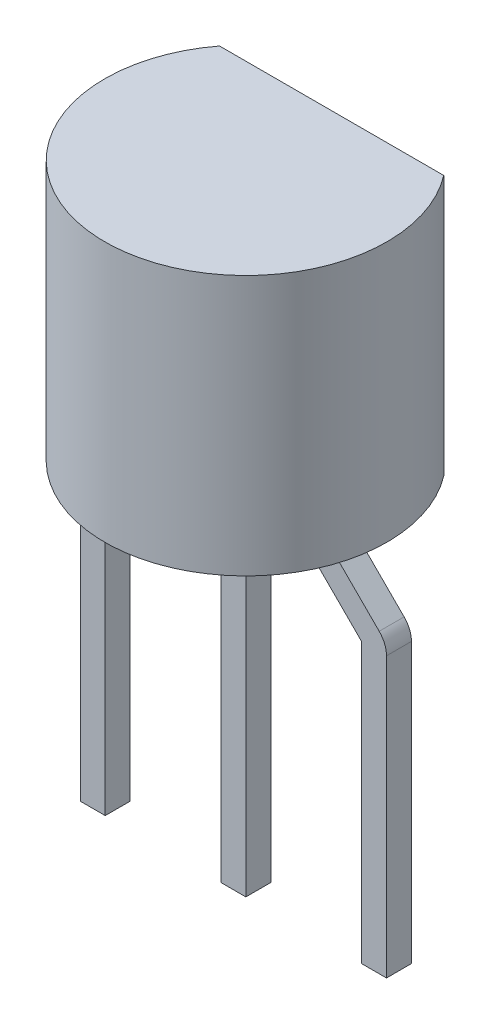
ISO-10303-21;
HEADER;
FILE_DESCRIPTION(('STEP AP214'),'2;1');
FILE_NAME('part.step','',(''),(''),'','','');
FILE_SCHEMA(('AUTOMOTIVE_DESIGN { 1 0 10303 214 1 1 1 1 }'));
ENDSEC;
DATA;
#1=APPLICATION_CONTEXT('core data for automotive mechanical design processes');
#2=APPLICATION_PROTOCOL_DEFINITION('international standard','automotive_design',2000,#1);
#3=PRODUCT_CONTEXT('',#1,'mechanical');
#4=PRODUCT('Part','Part','',(#3));
#5=PRODUCT_RELATED_PRODUCT_CATEGORY('part','',(#4));
#6=PRODUCT_DEFINITION_FORMATION('','',#4);
#7=PRODUCT_DEFINITION_CONTEXT('part definition',#1,'design');
#8=PRODUCT_DEFINITION('design','',#6,#7);
#9=PRODUCT_DEFINITION_SHAPE('','',#8);
#10=(LENGTH_UNIT() NAMED_UNIT(*) SI_UNIT(.MILLI.,.METRE.));
#11=(NAMED_UNIT(*) PLANE_ANGLE_UNIT() SI_UNIT($,.RADIAN.));
#12=(NAMED_UNIT(*) SI_UNIT($,.STERADIAN.) SOLID_ANGLE_UNIT());
#13=UNCERTAINTY_MEASURE_WITH_UNIT(LENGTH_MEASURE(1.E-05),#10,'distance_accuracy_value','');
#14=(GEOMETRIC_REPRESENTATION_CONTEXT(3) GLOBAL_UNCERTAINTY_ASSIGNED_CONTEXT((#13)) GLOBAL_UNIT_ASSIGNED_CONTEXT((#10,
#11,#12)) REPRESENTATION_CONTEXT('',''));
#15=CARTESIAN_POINT('',(0.,0.,0.));
#16=DIRECTION('',(0.,0.,1.));
#17=DIRECTION('',(1.,0.,0.));
#18=AXIS2_PLACEMENT_3D('',#15,#16,#17);
#19=CARTESIAN_POINT('',(-1.495,-0.1,0.225));
#20=DIRECTION('',(0.,0.,-1.));
#21=DIRECTION('',(-1.,0.,0.));
#22=AXIS2_PLACEMENT_3D('',#19,#20,#21);
#23=PLANE('',#22);
#24=DIRECTION('',(0.,1.,0.));
#25=VECTOR('',#24,1.);
#26=CARTESIAN_POINT('',(-1.495,-0.1,0.225));
#27=LINE('',#26,#25);
#28=CARTESIAN_POINT('',(-1.495,-0.1,0.225));
#29=VERTEX_POINT('',#28);
#30=CARTESIAN_POINT('',(-1.495,0.,0.225));
#31=VERTEX_POINT('',#30);
#32=EDGE_CURVE('E128',#29,#31,#27,.T.);
#33=ORIENTED_EDGE('',*,*,#32,.F.);
#34=DIRECTION('',(0.707106781186548,0.707106781186548,0.));
#35=VECTOR('',#34,1.);
#36=CARTESIAN_POINT('',(-2.63344191771,-1.23844191771,0.225));
#37=LINE('',#36,#35);
#38=CARTESIAN_POINT('',(-2.63344191770997,-1.23844191771003,0.225));
#39=VERTEX_POINT('',#38);
#40=EDGE_CURVE('E211',#29,#39,#37,.F.);
#41=ORIENTED_EDGE('',*,*,#40,.T.);
#42=CARTESIAN_POINT('',(-2.315243866176,-1.556639969244,0.225));
#43=DIRECTION('',(0.,0.,-1.));
#44=DIRECTION('',(-1.,0.,0.));
#45=AXIS2_PLACEMENT_3D('',#42,#43,#44);
#46=CIRCLE('',#45,0.45);
#47=CARTESIAN_POINT('',(-2.765243866176,-1.556639969244,0.225));
#48=VERTEX_POINT('',#47);
#49=EDGE_CURVE('E209',#48,#39,#46,.T.);
#50=ORIENTED_EDGE('',*,*,#49,.F.);
#51=DIRECTION('',(0.,1.,0.));
#52=VECTOR('',#51,1.);
#53=CARTESIAN_POINT('',(-2.765243866176,-6.596639969244,0.225));
#54=LINE('',#53,#52);
#55=CARTESIAN_POINT('',(-2.765243866176,-6.596639969244,0.225));
#56=VERTEX_POINT('',#55);
#57=EDGE_CURVE('E153',#48,#56,#54,.F.);
#58=ORIENTED_EDGE('',*,*,#57,.T.);
#59=DIRECTION('',(1.,0.,0.));
#60=VECTOR('',#59,1.);
#61=CARTESIAN_POINT('',(-2.765243866176,-6.596639969244,0.225));
#62=LINE('',#61,#60);
#63=CARTESIAN_POINT('',(-2.315243866176,-6.596639969244,0.225));
#64=VERTEX_POINT('',#63);
#65=EDGE_CURVE('E146',#64,#56,#62,.F.);
#66=ORIENTED_EDGE('',*,*,#65,.F.);
#67=DIRECTION('',(0.,-1.,0.));
#68=VECTOR('',#67,1.);
#69=CARTESIAN_POINT('',(-2.315243866176,-6.596639969244,0.225));
#70=LINE('',#69,#68);
#71=CARTESIAN_POINT('',(-2.315243866176,-1.556639969244,0.225));
#72=VERTEX_POINT('',#71);
#73=EDGE_CURVE('E248',#64,#72,#70,.F.);
#74=ORIENTED_EDGE('',*,*,#73,.T.);
#75=DIRECTION('',(-0.707106781186548,-0.707106781186548,0.));
#76=VECTOR('',#75,1.);
#77=CARTESIAN_POINT('',(-1.176801948466,-0.418198051534,0.225));
#78=LINE('',#77,#76);
#79=CARTESIAN_POINT('',(-1.17680194846603,-0.418198051533973,0.225));
#80=VERTEX_POINT('',#79);
#81=EDGE_CURVE('E139',#80,#72,#78,.T.);
#82=ORIENTED_EDGE('',*,*,#81,.F.);
#83=CARTESIAN_POINT('',(-1.495,-0.1,0.225));
#84=DIRECTION('',(0.,0.,1.));
#85=DIRECTION('',(1.,0.,0.));
#86=AXIS2_PLACEMENT_3D('',#83,#84,#85);
#87=CIRCLE('',#86,0.45);
#88=CARTESIAN_POINT('',(-1.045,-0.1,0.225));
#89=VERTEX_POINT('',#88);
#90=EDGE_CURVE('E20',#89,#80,#87,.F.);
#91=ORIENTED_EDGE('',*,*,#90,.F.);
#92=DIRECTION('',(0.,1.,0.));
#93=VECTOR('',#92,1.);
#94=CARTESIAN_POINT('',(-1.045,-0.1,0.225));
#95=LINE('',#94,#93);
#96=CARTESIAN_POINT('',(-1.045,0.,0.225));
#97=VERTEX_POINT('',#96);
#98=EDGE_CURVE('E109',#97,#89,#95,.F.);
#99=ORIENTED_EDGE('',*,*,#98,.F.);
#100=DIRECTION('',(-1.,0.,0.));
#101=VECTOR('',#100,1.);
#102=CARTESIAN_POINT('',(-1.495,0.,0.225));
#103=LINE('',#102,#101);
#104=EDGE_CURVE('E118',#31,#97,#103,.F.);
#105=ORIENTED_EDGE('',*,*,#104,.F.);
#106=EDGE_LOOP('',(#33,#41,#50,#58,#66,#74,#82,#91,#99,#105));
#107=FACE_BOUND('',#106,.T.);
#108=ADVANCED_FACE('F17',(#107),#23,.F.);
#109=CARTESIAN_POINT('',(1.045,-0.1,0.225));
#110=DIRECTION('',(0.,0.,-1.));
#111=DIRECTION('',(-1.,0.,0.));
#112=AXIS2_PLACEMENT_3D('',#109,#110,#111);
#113=PLANE('',#112);
#114=DIRECTION('',(0.,1.,0.));
#115=VECTOR('',#114,1.);
#116=CARTESIAN_POINT('',(1.045,-0.1,0.225));
#117=LINE('',#116,#115);
#118=CARTESIAN_POINT('',(1.045,-0.1,0.225));
#119=VERTEX_POINT('',#118);
#120=CARTESIAN_POINT('',(1.045,0.,0.225));
#121=VERTEX_POINT('',#120);
#122=EDGE_CURVE('E168',#119,#121,#117,.T.);
#123=ORIENTED_EDGE('',*,*,#122,.F.);
#124=CARTESIAN_POINT('',(1.495,-0.1,0.225));
#125=DIRECTION('',(0.,0.,-1.));
#126=DIRECTION('',(-1.,0.,0.));
#127=AXIS2_PLACEMENT_3D('',#124,#125,#126);
#128=CIRCLE('',#127,0.45);
#129=CARTESIAN_POINT('',(1.176801948466,-0.418198051534,0.225));
#130=VERTEX_POINT('',#129);
#131=EDGE_CURVE('E204',#130,#119,#128,.T.);
#132=ORIENTED_EDGE('',*,*,#131,.F.);
#133=DIRECTION('',(-0.707106781186548,0.707106781186548,0.));
#134=VECTOR('',#133,1.);
#135=CARTESIAN_POINT('',(2.315243866176,-1.556639969244,0.225));
#136=LINE('',#135,#134);
#137=CARTESIAN_POINT('',(2.315243866176,-1.556639969244,0.225));
#138=VERTEX_POINT('',#137);
#139=EDGE_CURVE('E207',#130,#138,#136,.F.);
#140=ORIENTED_EDGE('',*,*,#139,.T.);
#141=DIRECTION('',(0.,1.,0.));
#142=VECTOR('',#141,1.);
#143=CARTESIAN_POINT('',(2.315243866176,-6.596639969244,0.225));
#144=LINE('',#143,#142);
#145=CARTESIAN_POINT('',(2.315243866176,-6.596639969244,0.225));
#146=VERTEX_POINT('',#145);
#147=EDGE_CURVE('E237',#138,#146,#144,.F.);
#148=ORIENTED_EDGE('',*,*,#147,.T.);
#149=DIRECTION('',(1.,0.,0.));
#150=VECTOR('',#149,1.);
#151=CARTESIAN_POINT('',(2.315243866176,-6.596639969244,0.225));
#152=LINE('',#151,#150);
#153=CARTESIAN_POINT('',(2.765243866176,-6.596639969244,0.225));
#154=VERTEX_POINT('',#153);
#155=EDGE_CURVE('E230',#154,#146,#152,.F.);
#156=ORIENTED_EDGE('',*,*,#155,.F.);
#157=DIRECTION('',(0.,-1.,0.));
#158=VECTOR('',#157,1.);
#159=CARTESIAN_POINT('',(2.765243866176,-6.596639969244,0.225));
#160=LINE('',#159,#158);
#161=CARTESIAN_POINT('',(2.765243866176,-1.556639969244,0.225));
#162=VERTEX_POINT('',#161);
#163=EDGE_CURVE('E316',#154,#162,#160,.F.);
#164=ORIENTED_EDGE('',*,*,#163,.T.);
#165=CARTESIAN_POINT('',(2.315243866176,-1.556639969244,0.225));
#166=DIRECTION('',(0.,0.,1.));
#167=DIRECTION('',(1.,0.,0.));
#168=AXIS2_PLACEMENT_3D('',#165,#166,#167);
#169=CIRCLE('',#168,0.45);
#170=CARTESIAN_POINT('',(2.63344191771,-1.23844191771,0.225));
#171=VERTEX_POINT('',#170);
#172=EDGE_CURVE('E212',#171,#162,#169,.F.);
#173=ORIENTED_EDGE('',*,*,#172,.F.);
#174=DIRECTION('',(0.707106781186547,-0.707106781186548,0.));
#175=VECTOR('',#174,1.);
#176=CARTESIAN_POINT('',(1.495,-0.1,0.225));
#177=LINE('',#176,#175);
#178=CARTESIAN_POINT('',(1.495,-0.1,0.225));
#179=VERTEX_POINT('',#178);
#180=EDGE_CURVE('E173',#179,#171,#177,.T.);
#181=ORIENTED_EDGE('',*,*,#180,.F.);
#182=DIRECTION('',(0.,1.,0.));
#183=VECTOR('',#182,1.);
#184=CARTESIAN_POINT('',(1.495,-0.1,0.225));
#185=LINE('',#184,#183);
#186=CARTESIAN_POINT('',(1.495,0.,0.225));
#187=VERTEX_POINT('',#186);
#188=EDGE_CURVE('E127',#187,#179,#185,.F.);
#189=ORIENTED_EDGE('',*,*,#188,.F.);
#190=DIRECTION('',(-1.,0.,0.));
#191=VECTOR('',#190,1.);
#192=CARTESIAN_POINT('',(1.045,0.,0.225));
#193=LINE('',#192,#191);
#194=EDGE_CURVE('E164',#121,#187,#193,.F.);
#195=ORIENTED_EDGE('',*,*,#194,.F.);
#196=EDGE_LOOP('',(#123,#132,#140,#148,#156,#164,#173,#181,#189,#195));
#197=FACE_BOUND('',#196,.T.);
#198=ADVANCED_FACE('F528',(#197),#113,.F.);
#199=CARTESIAN_POINT('',(-0.225,-1.598630162281,0.225));
#200=DIRECTION('',(1.,0.,0.));
#201=DIRECTION('',(0.,0.,-1.));
#202=AXIS2_PLACEMENT_3D('',#199,#200,#201);
#203=PLANE('',#202);
#204=DIRECTION('',(0.,1.,0.));
#205=VECTOR('',#204,1.);
#206=CARTESIAN_POINT('',(-0.225,-1.598630162281,-0.225));
#207=LINE('',#206,#205);
#208=CARTESIAN_POINT('',(-0.225,0.,-0.225));
#209=VERTEX_POINT('',#208);
#210=CARTESIAN_POINT('',(-0.225,-6.598630162281,-0.225));
#211=VERTEX_POINT('',#210);
#212=EDGE_CURVE('E454',#209,#211,#207,.F.);
#213=ORIENTED_EDGE('',*,*,#212,.T.);
#214=DIRECTION('',(0.,0.,-1.));
#215=VECTOR('',#214,1.);
#216=CARTESIAN_POINT('',(-0.225,-6.598630162281,-0.225));
#217=LINE('',#216,#215);
#218=CARTESIAN_POINT('',(-0.225,-6.598630162281,0.225));
#219=VERTEX_POINT('',#218);
#220=EDGE_CURVE('E456',#219,#211,#217,.T.);
#221=ORIENTED_EDGE('',*,*,#220,.F.);
#222=DIRECTION('',(0.,1.,0.));
#223=VECTOR('',#222,1.);
#224=CARTESIAN_POINT('',(-0.225,-1.598630162281,0.225));
#225=LINE('',#224,#223);
#226=CARTESIAN_POINT('',(-0.225,0.,0.225));
#227=VERTEX_POINT('',#226);
#228=EDGE_CURVE('E503',#219,#227,#225,.T.);
#229=ORIENTED_EDGE('',*,*,#228,.T.);
#230=DIRECTION('',(0.,0.,-1.));
#231=VECTOR('',#230,1.);
#232=CARTESIAN_POINT('',(-0.225,0.,0.225));
#233=LINE('',#232,#231);
#234=EDGE_CURVE('E167',#209,#227,#233,.F.);
#235=ORIENTED_EDGE('',*,*,#234,.F.);
#236=EDGE_LOOP('',(#213,#221,#229,#235));
#237=FACE_BOUND('',#236,.T.);
#238=ADVANCED_FACE('F793',(#237),#203,.F.);
#239=CARTESIAN_POINT('',(-2.63344191771,-1.23844191771,-0.225));
#240=DIRECTION('',(0.707106781186548,-0.707106781186548,0.));
#241=DIRECTION('',(0.707106781186548,0.707106781186548,0.));
#242=AXIS2_PLACEMENT_3D('',#239,#240,#241);
#243=PLANE('',#242);
#244=DIRECTION('',(-0.707106781186547,-0.707106781186548,0.));
#245=VECTOR('',#244,1.);
#246=CARTESIAN_POINT('',(-1.495,-0.1,-0.225));
#247=LINE('',#246,#245);
#248=CARTESIAN_POINT('',(-1.495,-0.1,-0.225));
#249=VERTEX_POINT('',#248);
#250=CARTESIAN_POINT('',(-2.63344191770997,-1.23844191771003,-0.225));
#251=VERTEX_POINT('',#250);
#252=EDGE_CURVE('E203',#249,#251,#247,.T.);
#253=ORIENTED_EDGE('',*,*,#252,.T.);
#254=DIRECTION('',(0.,0.,-1.));
#255=VECTOR('',#254,1.);
#256=CARTESIAN_POINT('',(-2.63344191770995,-1.23844191771005,-0.225));
#257=LINE('',#256,#255);
#258=EDGE_CURVE('E157',#39,#251,#257,.T.);
#259=ORIENTED_EDGE('',*,*,#258,.F.);
#260=ORIENTED_EDGE('',*,*,#40,.F.);
#261=DIRECTION('',(0.,0.,-1.));
#262=VECTOR('',#261,1.);
#263=CARTESIAN_POINT('',(-1.495,-0.1,0.225));
#264=LINE('',#263,#262);
#265=EDGE_CURVE('E299',#29,#249,#264,.T.);
#266=ORIENTED_EDGE('',*,*,#265,.T.);
#267=EDGE_LOOP('',(#253,#259,#260,#266));
#268=FACE_BOUND('',#267,.T.);
#269=ADVANCED_FACE('F784',(#268),#243,.F.);
#270=CARTESIAN_POINT('',(-2.315243866176,-1.556639969244,-0.225));
#271=DIRECTION('',(0.,0.,-1.));
#272=DIRECTION('',(-1.,0.,0.));
#273=AXIS2_PLACEMENT_3D('',#270,#271,#272);
#274=CYLINDRICAL_SURFACE('',#273,0.45);
#275=ORIENTED_EDGE('',*,*,#258,.T.);
#276=CARTESIAN_POINT('',(-2.315243866176,-1.556639969244,-0.225));
#277=DIRECTION('',(0.,0.,-1.));
#278=DIRECTION('',(-1.,0.,0.));
#279=AXIS2_PLACEMENT_3D('',#276,#277,#278);
#280=CIRCLE('',#279,0.45);
#281=CARTESIAN_POINT('',(-2.765243866176,-1.556639969244,-0.225));
#282=VERTEX_POINT('',#281);
#283=EDGE_CURVE('E200',#251,#282,#280,.F.);
#284=ORIENTED_EDGE('',*,*,#283,.T.);
#285=DIRECTION('',(0.,0.,1.));
#286=VECTOR('',#285,1.);
#287=CARTESIAN_POINT('',(-2.765243866176,-1.556639969244,0.225));
#288=LINE('',#287,#286);
#289=EDGE_CURVE('E156',#282,#48,#288,.T.);
#290=ORIENTED_EDGE('',*,*,#289,.T.);
#291=ORIENTED_EDGE('',*,*,#49,.T.);
#292=EDGE_LOOP('',(#275,#284,#290,#291));
#293=FACE_BOUND('',#292,.T.);
#294=ADVANCED_FACE('F775',(#293),#274,.T.);
#295=CARTESIAN_POINT('',(-2.765243866176,-6.596639969244,0.225));
#296=DIRECTION('',(1.,0.,0.));
#297=DIRECTION('',(0.,1.,0.));
#298=AXIS2_PLACEMENT_3D('',#295,#296,#297);
#299=PLANE('',#298);
#300=DIRECTION('',(0.,1.,0.));
#301=VECTOR('',#300,1.);
#302=CARTESIAN_POINT('',(-2.765243866176,-0.1,-0.225));
#303=LINE('',#302,#301);
#304=CARTESIAN_POINT('',(-2.765243866176,-6.596639969244,-0.225));
#305=VERTEX_POINT('',#304);
#306=EDGE_CURVE('E202',#282,#305,#303,.F.);
#307=ORIENTED_EDGE('',*,*,#306,.T.);
#308=DIRECTION('',(0.,0.,1.));
#309=VECTOR('',#308,1.);
#310=CARTESIAN_POINT('',(-2.765243866176,-6.596639969244,-0.225));
#311=LINE('',#310,#309);
#312=EDGE_CURVE('E150',#56,#305,#311,.F.);
#313=ORIENTED_EDGE('',*,*,#312,.F.);
#314=ORIENTED_EDGE('',*,*,#57,.F.);
#315=ORIENTED_EDGE('',*,*,#289,.F.);
#316=EDGE_LOOP('',(#307,#313,#314,#315));
#317=FACE_BOUND('',#316,.T.);
#318=ADVANCED_FACE('F766',(#317),#299,.F.);
#319=CARTESIAN_POINT('',(-2.765243866176,-6.596639969244,-0.225));
#320=DIRECTION('',(0.,-1.,0.));
#321=DIRECTION('',(1.,0.,0.));
#322=AXIS2_PLACEMENT_3D('',#319,#320,#321);
#323=PLANE('',#322);
#324=DIRECTION('',(0.,0.,1.));
#325=VECTOR('',#324,1.);
#326=CARTESIAN_POINT('',(-2.315243866176,-6.596639969244,0.225));
#327=LINE('',#326,#325);
#328=CARTESIAN_POINT('',(-2.315243866176,-6.596639969244,-0.225));
#329=VERTEX_POINT('',#328);
#330=EDGE_CURVE('E149',#329,#64,#327,.T.);
#331=ORIENTED_EDGE('',*,*,#330,.T.);
#332=ORIENTED_EDGE('',*,*,#65,.T.);
#333=ORIENTED_EDGE('',*,*,#312,.T.);
#334=DIRECTION('',(1.,0.,0.));
#335=VECTOR('',#334,1.);
#336=CARTESIAN_POINT('',(-1.495,-6.596639969244,-0.225));
#337=LINE('',#336,#335);
#338=EDGE_CURVE('E278',#305,#329,#337,.T.);
#339=ORIENTED_EDGE('',*,*,#338,.T.);
#340=EDGE_LOOP('',(#331,#332,#333,#339));
#341=FACE_BOUND('',#340,.T.);
#342=ADVANCED_FACE('F758',(#341),#323,.T.);
#343=CARTESIAN_POINT('',(-2.315243866176,-6.596639969244,0.225));
#344=DIRECTION('',(-1.,0.,0.));
#345=DIRECTION('',(0.,-1.,0.));
#346=AXIS2_PLACEMENT_3D('',#343,#344,#345);
#347=PLANE('',#346);
#348=ORIENTED_EDGE('',*,*,#73,.F.);
#349=ORIENTED_EDGE('',*,*,#330,.F.);
#350=DIRECTION('',(0.,1.,0.));
#351=VECTOR('',#350,1.);
#352=CARTESIAN_POINT('',(-2.315243866176,-0.1,-0.225));
#353=LINE('',#352,#351);
#354=CARTESIAN_POINT('',(-2.315243866176,-1.556639969244,-0.225));
#355=VERTEX_POINT('',#354);
#356=EDGE_CURVE('E270',#329,#355,#353,.T.);
#357=ORIENTED_EDGE('',*,*,#356,.T.);
#358=DIRECTION('',(0.,0.,1.));
#359=VECTOR('',#358,1.);
#360=CARTESIAN_POINT('',(-2.315243866176,-1.556639969244,-0.225));
#361=LINE('',#360,#359);
#362=EDGE_CURVE('E251',#355,#72,#361,.T.);
#363=ORIENTED_EDGE('',*,*,#362,.T.);
#364=EDGE_LOOP('',(#348,#349,#357,#363));
#365=FACE_BOUND('',#364,.T.);
#366=ADVANCED_FACE('F268',(#365),#347,.F.);
#367=CARTESIAN_POINT('',(-2.315243866176,-1.556639969244,-0.225));
#368=DIRECTION('',(-0.707106781186548,0.707106781186548,0.));
#369=DIRECTION('',(-0.707106781186548,-0.707106781186548,0.));
#370=AXIS2_PLACEMENT_3D('',#367,#368,#369);
#371=PLANE('',#370);
#372=ORIENTED_EDGE('',*,*,#81,.T.);
#373=ORIENTED_EDGE('',*,*,#362,.F.);
#374=DIRECTION('',(0.707106781186548,0.707106781186548,0.));
#375=VECTOR('',#374,1.);
#376=CARTESIAN_POINT('',(-2.315243866176,-1.556639969244,-0.225));
#377=LINE('',#376,#375);
#378=CARTESIAN_POINT('',(-1.17680194846603,-0.418198051533973,-0.225));
#379=VERTEX_POINT('',#378);
#380=EDGE_CURVE('E199',#355,#379,#377,.T.);
#381=ORIENTED_EDGE('',*,*,#380,.T.);
#382=DIRECTION('',(0.,0.,1.));
#383=VECTOR('',#382,1.);
#384=CARTESIAN_POINT('',(-1.17680194846605,-0.418198051533947,0.225));
#385=LINE('',#384,#383);
#386=EDGE_CURVE('E208',#80,#379,#385,.F.);
#387=ORIENTED_EDGE('',*,*,#386,.F.);
#388=EDGE_LOOP('',(#372,#373,#381,#387));
#389=FACE_BOUND('',#388,.T.);
#390=ADVANCED_FACE('F257',(#389),#371,.F.);
#391=CARTESIAN_POINT('',(-1.495,-0.1,0.225));
#392=DIRECTION('',(0.,0.,1.));
#393=DIRECTION('',(1.,0.,0.));
#394=AXIS2_PLACEMENT_3D('',#391,#392,#393);
#395=CYLINDRICAL_SURFACE('',#394,0.45);
#396=CARTESIAN_POINT('',(-1.495,-0.1,-0.225));
#397=DIRECTION('',(0.,0.,1.));
#398=DIRECTION('',(1.,0.,0.));
#399=AXIS2_PLACEMENT_3D('',#396,#397,#398);
#400=CIRCLE('',#399,0.45);
#401=CARTESIAN_POINT('',(-1.045,-0.1,-0.225));
#402=VERTEX_POINT('',#401);
#403=EDGE_CURVE('E197',#379,#402,#400,.T.);
#404=ORIENTED_EDGE('',*,*,#403,.T.);
#405=DIRECTION('',(0.,0.,1.));
#406=VECTOR('',#405,1.);
#407=CARTESIAN_POINT('',(-1.045,-0.1,0.225));
#408=LINE('',#407,#406);
#409=EDGE_CURVE('E356',#402,#89,#408,.T.);
#410=ORIENTED_EDGE('',*,*,#409,.T.);
#411=ORIENTED_EDGE('',*,*,#90,.T.);
#412=ORIENTED_EDGE('',*,*,#386,.T.);
#413=EDGE_LOOP('',(#404,#410,#411,#412));
#414=FACE_BOUND('',#413,.T.);
#415=ADVANCED_FACE('F734',(#414),#395,.T.);
#416=CARTESIAN_POINT('',(1.495,-0.1,0.225));
#417=DIRECTION('',(0.,0.,-1.));
#418=DIRECTION('',(-1.,0.,0.));
#419=AXIS2_PLACEMENT_3D('',#416,#417,#418);
#420=CYLINDRICAL_SURFACE('',#419,0.45);
#421=ORIENTED_EDGE('',*,*,#131,.T.);
#422=DIRECTION('',(0.,0.,-1.));
#423=VECTOR('',#422,1.);
#424=CARTESIAN_POINT('',(1.045,-0.1,0.225));
#425=LINE('',#424,#423);
#426=CARTESIAN_POINT('',(1.045,-0.1,-0.225));
#427=VERTEX_POINT('',#426);
#428=EDGE_CURVE('E354',#119,#427,#425,.T.);
#429=ORIENTED_EDGE('',*,*,#428,.T.);
#430=CARTESIAN_POINT('',(1.495,-0.1,-0.225));
#431=DIRECTION('',(0.,0.,-1.));
#432=DIRECTION('',(-1.,0.,0.));
#433=AXIS2_PLACEMENT_3D('',#430,#431,#432);
#434=CIRCLE('',#433,0.45);
#435=CARTESIAN_POINT('',(1.176801948466,-0.418198051534,-0.225));
#436=VERTEX_POINT('',#435);
#437=EDGE_CURVE('E193',#427,#436,#434,.F.);
#438=ORIENTED_EDGE('',*,*,#437,.T.);
#439=DIRECTION('',(0.,0.,1.));
#440=VECTOR('',#439,1.);
#441=CARTESIAN_POINT('',(1.176801948466,-0.418198051534,0.225));
#442=LINE('',#441,#440);
#443=EDGE_CURVE('E241',#436,#130,#442,.T.);
#444=ORIENTED_EDGE('',*,*,#443,.T.);
#445=EDGE_LOOP('',(#421,#429,#438,#444));
#446=FACE_BOUND('',#445,.T.);
#447=ADVANCED_FACE('F725',(#446),#420,.T.);
#448=CARTESIAN_POINT('',(2.315243866176,-1.556639969244,0.225));
#449=DIRECTION('',(0.707106781186548,0.707106781186548,0.));
#450=DIRECTION('',(-0.707106781186548,0.707106781186548,0.));
#451=AXIS2_PLACEMENT_3D('',#448,#449,#450);
#452=PLANE('',#451);
#453=DIRECTION('',(0.707106781186548,-0.707106781186548,0.));
#454=VECTOR('',#453,1.);
#455=CARTESIAN_POINT('',(1.176801948466,-0.418198051534,-0.225));
#456=LINE('',#455,#454);
#457=CARTESIAN_POINT('',(2.315243866176,-1.556639969244,-0.225));
#458=VERTEX_POINT('',#457);
#459=EDGE_CURVE('E195',#436,#458,#456,.T.);
#460=ORIENTED_EDGE('',*,*,#459,.T.);
#461=DIRECTION('',(0.,0.,1.));
#462=VECTOR('',#461,1.);
#463=CARTESIAN_POINT('',(2.315243866176,-1.556639969244,0.225));
#464=LINE('',#463,#462);
#465=EDGE_CURVE('E240',#458,#138,#464,.T.);
#466=ORIENTED_EDGE('',*,*,#465,.T.);
#467=ORIENTED_EDGE('',*,*,#139,.F.);
#468=ORIENTED_EDGE('',*,*,#443,.F.);
#469=EDGE_LOOP('',(#460,#466,#467,#468));
#470=FACE_BOUND('',#469,.T.);
#471=ADVANCED_FACE('F716',(#470),#452,.F.);
#472=CARTESIAN_POINT('',(2.315243866176,-6.596639969244,0.225));
#473=DIRECTION('',(1.,0.,0.));
#474=DIRECTION('',(0.,1.,0.));
#475=AXIS2_PLACEMENT_3D('',#472,#473,#474);
#476=PLANE('',#475);
#477=DIRECTION('',(0.,1.,0.));
#478=VECTOR('',#477,1.);
#479=CARTESIAN_POINT('',(2.315243866176,-0.1,-0.225));
#480=LINE('',#479,#478);
#481=CARTESIAN_POINT('',(2.315243866176,-6.596639969244,-0.225));
#482=VERTEX_POINT('',#481);
#483=EDGE_CURVE('E337',#458,#482,#480,.F.);
#484=ORIENTED_EDGE('',*,*,#483,.T.);
#485=DIRECTION('',(0.,0.,1.));
#486=VECTOR('',#485,1.);
#487=CARTESIAN_POINT('',(2.315243866176,-6.596639969244,-0.225));
#488=LINE('',#487,#486);
#489=EDGE_CURVE('E234',#146,#482,#488,.F.);
#490=ORIENTED_EDGE('',*,*,#489,.F.);
#491=ORIENTED_EDGE('',*,*,#147,.F.);
#492=ORIENTED_EDGE('',*,*,#465,.F.);
#493=EDGE_LOOP('',(#484,#490,#491,#492));
#494=FACE_BOUND('',#493,.T.);
#495=ADVANCED_FACE('F545',(#494),#476,.F.);
#496=CARTESIAN_POINT('',(2.315243866176,-6.596639969244,-0.225));
#497=DIRECTION('',(0.,-1.,0.));
#498=DIRECTION('',(1.,0.,0.));
#499=AXIS2_PLACEMENT_3D('',#496,#497,#498);
#500=PLANE('',#499);
#501=DIRECTION('',(0.,0.,1.));
#502=VECTOR('',#501,1.);
#503=CARTESIAN_POINT('',(2.765243866176,-6.596639969244,0.225));
#504=LINE('',#503,#502);
#505=CARTESIAN_POINT('',(2.765243866176,-6.596639969244,-0.225));
#506=VERTEX_POINT('',#505);
#507=EDGE_CURVE('E233',#506,#154,#504,.T.);
#508=ORIENTED_EDGE('',*,*,#507,.T.);
#509=ORIENTED_EDGE('',*,*,#155,.T.);
#510=ORIENTED_EDGE('',*,*,#489,.T.);
#511=DIRECTION('',(1.,0.,0.));
#512=VECTOR('',#511,1.);
#513=CARTESIAN_POINT('',(1.045,-6.596639969244,-0.225));
#514=LINE('',#513,#512);
#515=EDGE_CURVE('E335',#482,#506,#514,.T.);
#516=ORIENTED_EDGE('',*,*,#515,.T.);
#517=EDGE_LOOP('',(#508,#509,#510,#516));
#518=FACE_BOUND('',#517,.T.);
#519=ADVANCED_FACE('F537',(#518),#500,.T.);
#520=CARTESIAN_POINT('',(2.765243866176,-6.596639969244,0.225));
#521=DIRECTION('',(-1.,0.,0.));
#522=DIRECTION('',(0.,-1.,0.));
#523=AXIS2_PLACEMENT_3D('',#520,#521,#522);
#524=PLANE('',#523);
#525=ORIENTED_EDGE('',*,*,#163,.F.);
#526=ORIENTED_EDGE('',*,*,#507,.F.);
#527=DIRECTION('',(0.,1.,0.));
#528=VECTOR('',#527,1.);
#529=CARTESIAN_POINT('',(2.765243866176,-0.1,-0.225));
#530=LINE('',#529,#528);
#531=CARTESIAN_POINT('',(2.765243866176,-1.556639969244,-0.225));
#532=VERTEX_POINT('',#531);
#533=EDGE_CURVE('E192',#506,#532,#530,.T.);
#534=ORIENTED_EDGE('',*,*,#533,.T.);
#535=DIRECTION('',(0.,0.,1.));
#536=VECTOR('',#535,1.);
#537=CARTESIAN_POINT('',(2.765243866176,-1.556639969244,0.225));
#538=LINE('',#537,#536);
#539=EDGE_CURVE('E318',#162,#532,#538,.F.);
#540=ORIENTED_EDGE('',*,*,#539,.F.);
#541=EDGE_LOOP('',(#525,#526,#534,#540));
#542=FACE_BOUND('',#541,.T.);
#543=ADVANCED_FACE('F535',(#542),#524,.F.);
#544=CARTESIAN_POINT('',(2.315243866176,-1.556639969244,0.225));
#545=DIRECTION('',(0.,0.,1.));
#546=DIRECTION('',(1.,0.,0.));
#547=AXIS2_PLACEMENT_3D('',#544,#545,#546);
#548=CYLINDRICAL_SURFACE('',#547,0.45);
#549=DIRECTION('',(0.,0.,1.));
#550=VECTOR('',#549,1.);
#551=CARTESIAN_POINT('',(2.63344191771,-1.23844191771,0.225));
#552=LINE('',#551,#550);
#553=CARTESIAN_POINT('',(2.63344191771,-1.23844191771,-0.225));
#554=VERTEX_POINT('',#553);
#555=EDGE_CURVE('E324',#554,#171,#552,.T.);
#556=ORIENTED_EDGE('',*,*,#555,.T.);
#557=ORIENTED_EDGE('',*,*,#172,.T.);
#558=ORIENTED_EDGE('',*,*,#539,.T.);
#559=CARTESIAN_POINT('',(2.315243866176,-1.556639969244,-0.225));
#560=DIRECTION('',(0.,0.,1.));
#561=DIRECTION('',(1.,0.,0.));
#562=AXIS2_PLACEMENT_3D('',#559,#560,#561);
#563=CIRCLE('',#562,0.45);
#564=EDGE_CURVE('E189',#532,#554,#563,.T.);
#565=ORIENTED_EDGE('',*,*,#564,.T.);
#566=EDGE_LOOP('',(#556,#557,#558,#565));
#567=FACE_BOUND('',#566,.T.);
#568=ADVANCED_FACE('F530',(#567),#548,.T.);
#569=CARTESIAN_POINT('',(2.63344191771,-1.23844191771,0.225));
#570=DIRECTION('',(-0.707106781186548,-0.707106781186548,0.));
#571=DIRECTION('',(0.707106781186548,-0.707106781186548,0.));
#572=AXIS2_PLACEMENT_3D('',#569,#570,#571);
#573=PLANE('',#572);
#574=ORIENTED_EDGE('',*,*,#180,.T.);
#575=ORIENTED_EDGE('',*,*,#555,.F.);
#576=DIRECTION('',(-0.707106781186547,0.707106781186548,0.));
#577=VECTOR('',#576,1.);
#578=CARTESIAN_POINT('',(2.63344191771,-1.23844191771,-0.225));
#579=LINE('',#578,#577);
#580=CARTESIAN_POINT('',(1.495,-0.1,-0.225));
#581=VERTEX_POINT('',#580);
#582=EDGE_CURVE('E191',#554,#581,#579,.T.);
#583=ORIENTED_EDGE('',*,*,#582,.T.);
#584=DIRECTION('',(0.,0.,1.));
#585=VECTOR('',#584,1.);
#586=CARTESIAN_POINT('',(1.495,-0.1,0.225));
#587=LINE('',#586,#585);
#588=EDGE_CURVE('E513',#179,#581,#587,.F.);
#589=ORIENTED_EDGE('',*,*,#588,.F.);
#590=EDGE_LOOP('',(#574,#575,#583,#589));
#591=FACE_BOUND('',#590,.T.);
#592=ADVANCED_FACE('F529',(#591),#573,.F.);
#593=CARTESIAN_POINT('',(-0.225,-1.598630162281,-0.225));
#594=DIRECTION('',(0.,0.,1.));
#595=DIRECTION('',(1.,0.,0.));
#596=AXIS2_PLACEMENT_3D('',#593,#594,#595);
#597=PLANE('',#596);
#598=DIRECTION('',(0.,1.,0.));
#599=VECTOR('',#598,1.);
#600=CARTESIAN_POINT('',(0.225,-1.598630162281,-0.225));
#601=LINE('',#600,#599);
#602=CARTESIAN_POINT('',(0.225,0.,-0.225));
#603=VERTEX_POINT('',#602);
#604=CARTESIAN_POINT('',(0.225,-6.598630162281,-0.225));
#605=VERTEX_POINT('',#604);
#606=EDGE_CURVE('E452',#603,#605,#601,.F.);
#607=ORIENTED_EDGE('',*,*,#606,.T.);
#608=DIRECTION('',(1.,0.,0.));
#609=VECTOR('',#608,1.);
#610=CARTESIAN_POINT('',(-0.225,-6.598630162281,-0.225));
#611=LINE('',#610,#609);
#612=EDGE_CURVE('E508',#211,#605,#611,.T.);
#613=ORIENTED_EDGE('',*,*,#612,.F.);
#614=ORIENTED_EDGE('',*,*,#212,.F.);
#615=DIRECTION('',(1.,0.,0.));
#616=VECTOR('',#615,1.);
#617=CARTESIAN_POINT('',(-0.225,0.,-0.225));
#618=LINE('',#617,#616);
#619=EDGE_CURVE('E448',#603,#209,#618,.F.);
#620=ORIENTED_EDGE('',*,*,#619,.F.);
#621=EDGE_LOOP('',(#607,#613,#614,#620));
#622=FACE_BOUND('',#621,.T.);
#623=ADVANCED_FACE('F450',(#622),#597,.F.);
#624=CARTESIAN_POINT('',(-0.225,-6.598630162281,-0.225));
#625=DIRECTION('',(0.,-1.,0.));
#626=DIRECTION('',(0.,0.,-1.));
#627=AXIS2_PLACEMENT_3D('',#624,#625,#626);
#628=PLANE('',#627);
#629=DIRECTION('',(0.,0.,1.));
#630=VECTOR('',#629,1.);
#631=CARTESIAN_POINT('',(0.225,-6.598630162281,0.225));
#632=LINE('',#631,#630);
#633=CARTESIAN_POINT('',(0.225,-6.598630162281,0.225));
#634=VERTEX_POINT('',#633);
#635=EDGE_CURVE('E463',#605,#634,#632,.T.);
#636=ORIENTED_EDGE('',*,*,#635,.T.);
#637=DIRECTION('',(-1.,0.,0.));
#638=VECTOR('',#637,1.);
#639=CARTESIAN_POINT('',(-0.225,-6.598630162281,0.225));
#640=LINE('',#639,#638);
#641=EDGE_CURVE('E505',#634,#219,#640,.T.);
#642=ORIENTED_EDGE('',*,*,#641,.T.);
#643=ORIENTED_EDGE('',*,*,#220,.T.);
#644=ORIENTED_EDGE('',*,*,#612,.T.);
#645=EDGE_LOOP('',(#636,#642,#643,#644));
#646=FACE_BOUND('',#645,.T.);
#647=ADVANCED_FACE('F582',(#646),#628,.T.);
#648=CARTESIAN_POINT('',(-0.225,-1.598630162281,0.225));
#649=DIRECTION('',(0.,0.,-1.));
#650=DIRECTION('',(-1.,0.,0.));
#651=AXIS2_PLACEMENT_3D('',#648,#649,#650);
#652=PLANE('',#651);
#653=ORIENTED_EDGE('',*,*,#228,.F.);
#654=ORIENTED_EDGE('',*,*,#641,.F.);
#655=DIRECTION('',(0.,1.,0.));
#656=VECTOR('',#655,1.);
#657=CARTESIAN_POINT('',(0.225,-1.598630162281,0.225));
#658=LINE('',#657,#656);
#659=CARTESIAN_POINT('',(0.225,0.,0.225));
#660=VERTEX_POINT('',#659);
#661=EDGE_CURVE('E477',#634,#660,#658,.T.);
#662=ORIENTED_EDGE('',*,*,#661,.T.);
#663=DIRECTION('',(-1.,0.,0.));
#664=VECTOR('',#663,1.);
#665=CARTESIAN_POINT('',(-0.225,0.,0.225));
#666=LINE('',#665,#664);
#667=EDGE_CURVE('E304',#227,#660,#666,.F.);
#668=ORIENTED_EDGE('',*,*,#667,.F.);
#669=EDGE_LOOP('',(#653,#654,#662,#668));
#670=FACE_BOUND('',#669,.T.);
#671=ADVANCED_FACE('F579',(#670),#652,.F.);
#672=CARTESIAN_POINT('',(-1.495,-0.1,0.225));
#673=DIRECTION('',(1.,0.,0.));
#674=DIRECTION('',(0.,0.,-1.));
#675=AXIS2_PLACEMENT_3D('',#672,#673,#674);
#676=PLANE('',#675);
#677=DIRECTION('',(0.,1.,0.));
#678=VECTOR('',#677,1.);
#679=CARTESIAN_POINT('',(-1.495,-0.1,-0.225));
#680=LINE('',#679,#678);
#681=CARTESIAN_POINT('',(-1.495,0.,-0.225));
#682=VERTEX_POINT('',#681);
#683=EDGE_CURVE('E296',#682,#249,#680,.F.);
#684=ORIENTED_EDGE('',*,*,#683,.T.);
#685=ORIENTED_EDGE('',*,*,#265,.F.);
#686=ORIENTED_EDGE('',*,*,#32,.T.);
#687=DIRECTION('',(0.,0.,1.));
#688=VECTOR('',#687,1.);
#689=CARTESIAN_POINT('',(-1.495,0.,0.));
#690=LINE('',#689,#688);
#691=EDGE_CURVE('E124',#31,#682,#690,.F.);
#692=ORIENTED_EDGE('',*,*,#691,.T.);
#693=EDGE_LOOP('',(#684,#685,#686,#692));
#694=FACE_BOUND('',#693,.T.);
#695=ADVANCED_FACE('F576',(#694),#676,.F.);
#696=CARTESIAN_POINT('',(-1.495,-0.1,-0.225));
#697=DIRECTION('',(0.,0.,1.));
#698=DIRECTION('',(1.,0.,0.));
#699=AXIS2_PLACEMENT_3D('',#696,#697,#698);
#700=PLANE('',#699);
#701=DIRECTION('',(0.,1.,0.));
#702=VECTOR('',#701,1.);
#703=CARTESIAN_POINT('',(-1.045,-0.1,-0.225));
#704=LINE('',#703,#702);
#705=CARTESIAN_POINT('',(-1.045,0.,-0.225));
#706=VERTEX_POINT('',#705);
#707=EDGE_CURVE('E133',#706,#402,#704,.F.);
#708=ORIENTED_EDGE('',*,*,#707,.T.);
#709=ORIENTED_EDGE('',*,*,#403,.F.);
#710=ORIENTED_EDGE('',*,*,#380,.F.);
#711=ORIENTED_EDGE('',*,*,#356,.F.);
#712=ORIENTED_EDGE('',*,*,#338,.F.);
#713=ORIENTED_EDGE('',*,*,#306,.F.);
#714=ORIENTED_EDGE('',*,*,#283,.F.);
#715=ORIENTED_EDGE('',*,*,#252,.F.);
#716=ORIENTED_EDGE('',*,*,#683,.F.);
#717=DIRECTION('',(1.,0.,0.));
#718=VECTOR('',#717,1.);
#719=CARTESIAN_POINT('',(0.,0.,-0.225));
#720=LINE('',#719,#718);
#721=EDGE_CURVE('E134',#682,#706,#720,.T.);
#722=ORIENTED_EDGE('',*,*,#721,.T.);
#723=EDGE_LOOP('',(#708,#709,#710,#711,#712,#713,#714,#715,#716,#722));
#724=FACE_BOUND('',#723,.T.);
#725=ADVANCED_FACE('F376',(#724),#700,.F.);
#726=CARTESIAN_POINT('',(-1.045,-0.1,0.225));
#727=DIRECTION('',(-1.,0.,0.));
#728=DIRECTION('',(0.,0.,1.));
#729=AXIS2_PLACEMENT_3D('',#726,#727,#728);
#730=PLANE('',#729);
#731=ORIENTED_EDGE('',*,*,#98,.T.);
#732=ORIENTED_EDGE('',*,*,#409,.F.);
#733=ORIENTED_EDGE('',*,*,#707,.F.);
#734=DIRECTION('',(0.,0.,1.));
#735=VECTOR('',#734,1.);
#736=CARTESIAN_POINT('',(-1.045,0.,0.));
#737=LINE('',#736,#735);
#738=EDGE_CURVE('E122',#706,#97,#737,.T.);
#739=ORIENTED_EDGE('',*,*,#738,.T.);
#740=EDGE_LOOP('',(#731,#732,#733,#739));
#741=FACE_BOUND('',#740,.T.);
#742=ADVANCED_FACE('F131',(#741),#730,.F.);
#743=CARTESIAN_POINT('',(1.045,-0.1,0.225));
#744=DIRECTION('',(1.,0.,0.));
#745=DIRECTION('',(0.,0.,-1.));
#746=AXIS2_PLACEMENT_3D('',#743,#744,#745);
#747=PLANE('',#746);
#748=DIRECTION('',(0.,1.,0.));
#749=VECTOR('',#748,1.);
#750=CARTESIAN_POINT('',(1.045,-0.1,-0.225));
#751=LINE('',#750,#749);
#752=CARTESIAN_POINT('',(1.045,0.,-0.225));
#753=VERTEX_POINT('',#752);
#754=EDGE_CURVE('E196',#753,#427,#751,.F.);
#755=ORIENTED_EDGE('',*,*,#754,.T.);
#756=ORIENTED_EDGE('',*,*,#428,.F.);
#757=ORIENTED_EDGE('',*,*,#122,.T.);
#758=DIRECTION('',(0.,0.,1.));
#759=VECTOR('',#758,1.);
#760=CARTESIAN_POINT('',(1.045,0.,0.));
#761=LINE('',#760,#759);
#762=EDGE_CURVE('E357',#121,#753,#761,.F.);
#763=ORIENTED_EDGE('',*,*,#762,.T.);
#764=EDGE_LOOP('',(#755,#756,#757,#763));
#765=FACE_BOUND('',#764,.T.);
#766=ADVANCED_FACE('F569',(#765),#747,.F.);
#767=CARTESIAN_POINT('',(1.045,-0.1,-0.225));
#768=DIRECTION('',(0.,0.,1.));
#769=DIRECTION('',(1.,0.,0.));
#770=AXIS2_PLACEMENT_3D('',#767,#768,#769);
#771=PLANE('',#770);
#772=DIRECTION('',(0.,1.,0.));
#773=VECTOR('',#772,1.);
#774=CARTESIAN_POINT('',(1.495,-0.1,-0.225));
#775=LINE('',#774,#773);
#776=CARTESIAN_POINT('',(1.495,0.,-0.225));
#777=VERTEX_POINT('',#776);
#778=EDGE_CURVE('E464',#777,#581,#775,.F.);
#779=ORIENTED_EDGE('',*,*,#778,.T.);
#780=ORIENTED_EDGE('',*,*,#582,.F.);
#781=ORIENTED_EDGE('',*,*,#564,.F.);
#782=ORIENTED_EDGE('',*,*,#533,.F.);
#783=ORIENTED_EDGE('',*,*,#515,.F.);
#784=ORIENTED_EDGE('',*,*,#483,.F.);
#785=ORIENTED_EDGE('',*,*,#459,.F.);
#786=ORIENTED_EDGE('',*,*,#437,.F.);
#787=ORIENTED_EDGE('',*,*,#754,.F.);
#788=DIRECTION('',(1.,0.,0.));
#789=VECTOR('',#788,1.);
#790=CARTESIAN_POINT('',(0.,0.,-0.225));
#791=LINE('',#790,#789);
#792=EDGE_CURVE('E180',#753,#777,#791,.T.);
#793=ORIENTED_EDGE('',*,*,#792,.T.);
#794=EDGE_LOOP('',(#779,#780,#781,#782,#783,#784,#785,#786,#787,#793));
#795=FACE_BOUND('',#794,.T.);
#796=ADVANCED_FACE('F520',(#795),#771,.F.);
#797=CARTESIAN_POINT('',(1.495,-0.1,0.225));
#798=DIRECTION('',(-1.,0.,0.));
#799=DIRECTION('',(0.,0.,1.));
#800=AXIS2_PLACEMENT_3D('',#797,#798,#799);
#801=PLANE('',#800);
#802=ORIENTED_EDGE('',*,*,#188,.T.);
#803=ORIENTED_EDGE('',*,*,#588,.T.);
#804=ORIENTED_EDGE('',*,*,#778,.F.);
#805=DIRECTION('',(0.,0.,1.));
#806=VECTOR('',#805,1.);
#807=CARTESIAN_POINT('',(1.495,0.,0.));
#808=LINE('',#807,#806);
#809=EDGE_CURVE('E176',#777,#187,#808,.T.);
#810=ORIENTED_EDGE('',*,*,#809,.T.);
#811=EDGE_LOOP('',(#802,#803,#804,#810));
#812=FACE_BOUND('',#811,.T.);
#813=ADVANCED_FACE('F524',(#812),#801,.F.);
#814=CARTESIAN_POINT('',(0.225,-1.598630162281,0.225));
#815=DIRECTION('',(-1.,0.,0.));
#816=DIRECTION('',(0.,0.,1.));
#817=AXIS2_PLACEMENT_3D('',#814,#815,#816);
#818=PLANE('',#817);
#819=ORIENTED_EDGE('',*,*,#661,.F.);
#820=ORIENTED_EDGE('',*,*,#635,.F.);
#821=ORIENTED_EDGE('',*,*,#606,.F.);
#822=DIRECTION('',(0.,0.,1.));
#823=VECTOR('',#822,1.);
#824=CARTESIAN_POINT('',(0.225,0.,0.));
#825=LINE('',#824,#823);
#826=EDGE_CURVE('E179',#603,#660,#825,.T.);
#827=ORIENTED_EDGE('',*,*,#826,.T.);
#828=EDGE_LOOP('',(#819,#820,#821,#827));
#829=FACE_BOUND('',#828,.T.);
#830=ADVANCED_FACE('F462',(#829),#818,.F.);
#831=CARTESIAN_POINT('',(0.,4.7,0.));
#832=DIRECTION('',(0.,1.,0.));
#833=DIRECTION('',(0.,0.,1.));
#834=AXIS2_PLACEMENT_3D('',#831,#832,#833);
#835=PLANE('',#834);
#836=CARTESIAN_POINT('',(0.,4.7,0.));
#837=DIRECTION('',(0.,-1.,0.));
#838=DIRECTION('',(0.,0.,-1.));
#839=AXIS2_PLACEMENT_3D('',#836,#837,#838);
#840=CIRCLE('',#839,2.55);
#841=CARTESIAN_POINT('',(2.02484567313172,4.7,-1.54999999999992));
#842=VERTEX_POINT('',#841);
#843=CARTESIAN_POINT('',(-2.02484567313172,4.7,-1.54999999999992));
#844=VERTEX_POINT('',#843);
#845=EDGE_CURVE('E185',#842,#844,#840,.T.);
#846=ORIENTED_EDGE('',*,*,#845,.F.);
#847=DIRECTION('',(-1.,0.,0.));
#848=VECTOR('',#847,1.);
#849=CARTESIAN_POINT('',(-5.751421356237,4.7,-1.55));
#850=LINE('',#849,#848);
#851=EDGE_CURVE('E308',#844,#842,#850,.F.);
#852=ORIENTED_EDGE('',*,*,#851,.F.);
#853=EDGE_LOOP('',(#846,#852));
#854=FACE_BOUND('',#853,.T.);
#855=ADVANCED_FACE('F559',(#854),#835,.T.);
#856=CARTESIAN_POINT('',(-5.751421356237,4.7,-1.55));
#857=DIRECTION('',(0.,0.,-1.));
#858=DIRECTION('',(-1.,0.,0.));
#859=AXIS2_PLACEMENT_3D('',#856,#857,#858);
#860=PLANE('',#859);
#861=ORIENTED_EDGE('',*,*,#851,.T.);
#862=DIRECTION('',(0.,-1.,0.));
#863=VECTOR('',#862,1.);
#864=CARTESIAN_POINT('',(2.02484567313178,4.7,-1.54999999999984));
#865=LINE('',#864,#863);
#866=CARTESIAN_POINT('',(2.02484567313172,0.,-1.54999999999992));
#867=VERTEX_POINT('',#866);
#868=EDGE_CURVE('E188',#867,#842,#865,.F.);
#869=ORIENTED_EDGE('',*,*,#868,.F.);
#870=DIRECTION('',(1.,0.,0.));
#871=VECTOR('',#870,1.);
#872=CARTESIAN_POINT('',(0.,0.,-1.55));
#873=LINE('',#872,#871);
#874=CARTESIAN_POINT('',(-2.02484567313172,0.,-1.54999999999992));
#875=VERTEX_POINT('',#874);
#876=EDGE_CURVE('E35',#867,#875,#873,.F.);
#877=ORIENTED_EDGE('',*,*,#876,.T.);
#878=DIRECTION('',(0.,-1.,0.));
#879=VECTOR('',#878,1.);
#880=CARTESIAN_POINT('',(-2.02484567313178,4.7,-1.54999999999984));
#881=LINE('',#880,#879);
#882=EDGE_CURVE('E26',#844,#875,#881,.T.);
#883=ORIENTED_EDGE('',*,*,#882,.F.);
#884=EDGE_LOOP('',(#861,#869,#877,#883));
#885=FACE_BOUND('',#884,.T.);
#886=ADVANCED_FACE('F554',(#885),#860,.T.);
#887=CARTESIAN_POINT('',(0.,0.,0.));
#888=DIRECTION('',(0.,1.,0.));
#889=DIRECTION('',(0.,0.,1.));
#890=AXIS2_PLACEMENT_3D('',#887,#888,#889);
#891=PLANE('',#890);
#892=ORIENTED_EDGE('',*,*,#619,.T.);
#893=ORIENTED_EDGE('',*,*,#234,.T.);
#894=ORIENTED_EDGE('',*,*,#667,.T.);
#895=ORIENTED_EDGE('',*,*,#826,.F.);
#896=EDGE_LOOP('',(#892,#893,#894,#895));
#897=FACE_BOUND('',#896,.T.);
#898=ORIENTED_EDGE('',*,*,#792,.F.);
#899=ORIENTED_EDGE('',*,*,#762,.F.);
#900=ORIENTED_EDGE('',*,*,#194,.T.);
#901=ORIENTED_EDGE('',*,*,#809,.F.);
#902=EDGE_LOOP('',(#898,#899,#900,#901));
#903=FACE_BOUND('',#902,.T.);
#904=CARTESIAN_POINT('',(0.,0.,0.));
#905=DIRECTION('',(0.,-1.,0.));
#906=DIRECTION('',(0.,0.,-1.));
#907=AXIS2_PLACEMENT_3D('',#904,#905,#906);
#908=CIRCLE('',#907,2.55);
#909=EDGE_CURVE('E11',#875,#867,#908,.F.);
#910=ORIENTED_EDGE('',*,*,#909,.F.);
#911=ORIENTED_EDGE('',*,*,#876,.F.);
#912=EDGE_LOOP('',(#910,#911));
#913=FACE_BOUND('',#912,.T.);
#914=ORIENTED_EDGE('',*,*,#721,.F.);
#915=ORIENTED_EDGE('',*,*,#691,.F.);
#916=ORIENTED_EDGE('',*,*,#104,.T.);
#917=ORIENTED_EDGE('',*,*,#738,.F.);
#918=EDGE_LOOP('',(#914,#915,#916,#917));
#919=FACE_BOUND('',#918,.T.);
#920=ADVANCED_FACE('F120',(#897,#903,#913,#919),#891,.F.);
#921=CARTESIAN_POINT('',(0.,4.7,0.));
#922=DIRECTION('',(0.,-1.,0.));
#923=DIRECTION('',(0.,0.,-1.));
#924=AXIS2_PLACEMENT_3D('',#921,#922,#923);
#925=CYLINDRICAL_SURFACE('',#924,2.55);
#926=ORIENTED_EDGE('',*,*,#882,.T.);
#927=ORIENTED_EDGE('',*,*,#909,.T.);
#928=ORIENTED_EDGE('',*,*,#868,.T.);
#929=ORIENTED_EDGE('',*,*,#845,.T.);
#930=EDGE_LOOP('',(#926,#927,#928,#929));
#931=FACE_BOUND('',#930,.T.);
#932=ADVANCED_FACE('F547',(#931),#925,.T.);
#933=CLOSED_SHELL('',(#108,#198,#238,#269,#294,#318,#342,#366,#390,#415,#447,#471,#495,#519,
#543,#568,#592,#623,#647,#671,#695,#725,#742,#766,#796,#813,#830,#855,#886,#920,#932));
#934=MANIFOLD_SOLID_BREP('B1',#933);
#935=ADVANCED_BREP_SHAPE_REPRESENTATION('',(#18,#934),#14);
#936=SHAPE_DEFINITION_REPRESENTATION(#9,#935);
ENDSEC;
END-ISO-10303-21;
